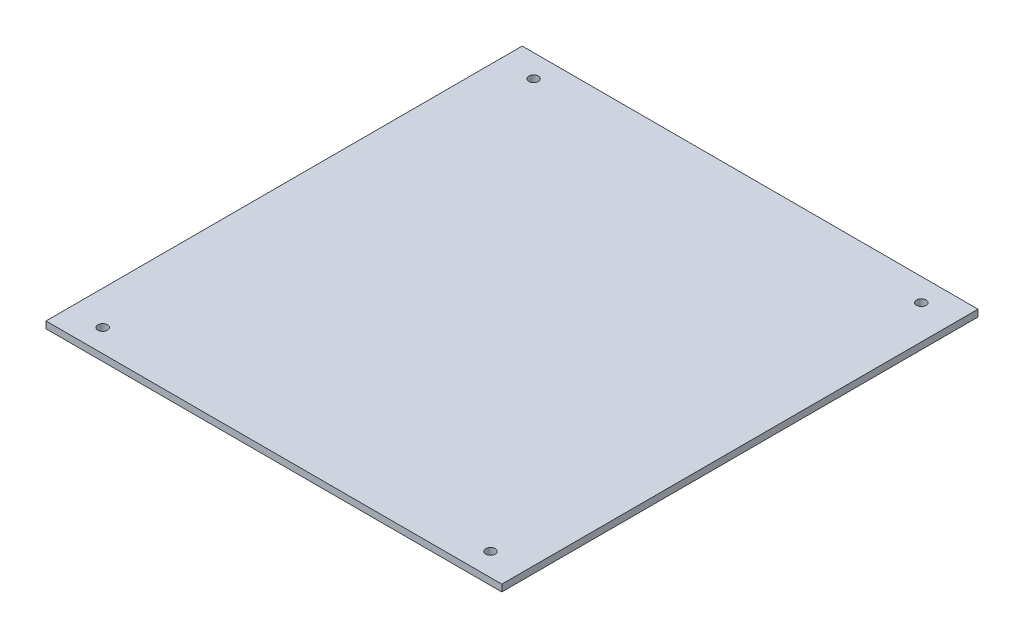
ISO-10303-21;
HEADER;
FILE_DESCRIPTION(('STEP AP214'),'2;1');
FILE_NAME('part.step','',(''),(''),'','','');
FILE_SCHEMA(('AUTOMOTIVE_DESIGN { 1 0 10303 214 1 1 1 1 }'));
ENDSEC;
DATA;
#1=APPLICATION_CONTEXT('core data for automotive mechanical design processes');
#2=APPLICATION_PROTOCOL_DEFINITION('international standard','automotive_design',2000,#1);
#3=PRODUCT_CONTEXT('',#1,'mechanical');
#4=PRODUCT('Part','Part','',(#3));
#5=PRODUCT_RELATED_PRODUCT_CATEGORY('part','',(#4));
#6=PRODUCT_DEFINITION_FORMATION('','',#4);
#7=PRODUCT_DEFINITION_CONTEXT('part definition',#1,'design');
#8=PRODUCT_DEFINITION('design','',#6,#7);
#9=PRODUCT_DEFINITION_SHAPE('','',#8);
#10=(LENGTH_UNIT() NAMED_UNIT(*) SI_UNIT(.MILLI.,.METRE.));
#11=(NAMED_UNIT(*) PLANE_ANGLE_UNIT() SI_UNIT($,.RADIAN.));
#12=(NAMED_UNIT(*) SI_UNIT($,.STERADIAN.) SOLID_ANGLE_UNIT());
#13=UNCERTAINTY_MEASURE_WITH_UNIT(LENGTH_MEASURE(1.E-05),#10,'distance_accuracy_value','');
#14=(GEOMETRIC_REPRESENTATION_CONTEXT(3) GLOBAL_UNCERTAINTY_ASSIGNED_CONTEXT((#13)) GLOBAL_UNIT_ASSIGNED_CONTEXT((#10,
#11,#12)) REPRESENTATION_CONTEXT('',''));
#15=CARTESIAN_POINT('',(0.,0.,0.));
#16=DIRECTION('',(0.,0.,1.));
#17=DIRECTION('',(1.,0.,0.));
#18=AXIS2_PLACEMENT_3D('',#15,#16,#17);
#19=CARTESIAN_POINT('',(0.,3.,0.));
#20=DIRECTION('',(0.,1.,0.));
#21=DIRECTION('',(0.,0.,1.));
#22=AXIS2_PLACEMENT_3D('',#19,#20,#21);
#23=PLANE('',#22);
#24=CARTESIAN_POINT('',(85.5,3.,95.));
#25=DIRECTION('',(0.,1.,0.));
#26=DIRECTION('',(0.,0.,1.));
#27=AXIS2_PLACEMENT_3D('',#24,#25,#26);
#28=CIRCLE('',#27,2.1);
#29=CARTESIAN_POINT('',(85.5,3.,97.1));
#30=VERTEX_POINT('',#29);
#31=EDGE_CURVE('E121',#30,#30,#28,.T.);
#32=ORIENTED_EDGE('',*,*,#31,.F.);
#33=EDGE_LOOP('',(#32));
#34=FACE_BOUND('',#33,.T.);
#35=CARTESIAN_POINT('',(-85.5000000000001,3.,-95.));
#36=DIRECTION('',(0.,1.,0.));
#37=DIRECTION('',(0.,0.,1.));
#38=AXIS2_PLACEMENT_3D('',#35,#36,#37);
#39=CIRCLE('',#38,2.1);
#40=CARTESIAN_POINT('',(-85.5000000000001,3.,-92.9));
#41=VERTEX_POINT('',#40);
#42=EDGE_CURVE('E100',#41,#41,#39,.T.);
#43=ORIENTED_EDGE('',*,*,#42,.F.);
#44=EDGE_LOOP('',(#43));
#45=FACE_BOUND('',#44,.T.);
#46=DIRECTION('',(0.,0.,-1.));
#47=VECTOR('',#46,1.);
#48=CARTESIAN_POINT('',(100.5,3.,-105.));
#49=LINE('',#48,#47);
#50=CARTESIAN_POINT('',(100.5,3.,105.));
#51=VERTEX_POINT('',#50);
#52=CARTESIAN_POINT('',(100.5,3.,-105.));
#53=VERTEX_POINT('',#52);
#54=EDGE_CURVE('E85',#51,#53,#49,.T.);
#55=ORIENTED_EDGE('',*,*,#54,.T.);
#56=DIRECTION('',(-1.,0.,0.));
#57=VECTOR('',#56,1.);
#58=CARTESIAN_POINT('',(-100.5,3.,-105.));
#59=LINE('',#58,#57);
#60=CARTESIAN_POINT('',(-100.5,3.,-105.));
#61=VERTEX_POINT('',#60);
#62=EDGE_CURVE('E80',#53,#61,#59,.T.);
#63=ORIENTED_EDGE('',*,*,#62,.T.);
#64=DIRECTION('',(0.,0.,1.));
#65=VECTOR('',#64,1.);
#66=CARTESIAN_POINT('',(-100.5,3.,-105.));
#67=LINE('',#66,#65);
#68=CARTESIAN_POINT('',(-100.5,3.,105.));
#69=VERTEX_POINT('',#68);
#70=EDGE_CURVE('E83',#61,#69,#67,.T.);
#71=ORIENTED_EDGE('',*,*,#70,.T.);
#72=DIRECTION('',(1.,0.,0.));
#73=VECTOR('',#72,1.);
#74=CARTESIAN_POINT('',(-100.5,3.,105.));
#75=LINE('',#74,#73);
#76=EDGE_CURVE('E50',#69,#51,#75,.T.);
#77=ORIENTED_EDGE('',*,*,#76,.T.);
#78=EDGE_LOOP('',(#55,#63,#71,#77));
#79=FACE_BOUND('',#78,.T.);
#80=CARTESIAN_POINT('',(85.5,3.,-95.));
#81=DIRECTION('',(0.,1.,0.));
#82=DIRECTION('',(0.,0.,1.));
#83=AXIS2_PLACEMENT_3D('',#80,#81,#82);
#84=CIRCLE('',#83,2.1);
#85=CARTESIAN_POINT('',(85.5,3.,-92.9));
#86=VERTEX_POINT('',#85);
#87=EDGE_CURVE('E115',#86,#86,#84,.T.);
#88=ORIENTED_EDGE('',*,*,#87,.F.);
#89=EDGE_LOOP('',(#88));
#90=FACE_BOUND('',#89,.T.);
#91=CARTESIAN_POINT('',(-85.5,3.,95.));
#92=DIRECTION('',(0.,1.,0.));
#93=DIRECTION('',(0.,0.,1.));
#94=AXIS2_PLACEMENT_3D('',#91,#92,#93);
#95=CIRCLE('',#94,2.1);
#96=CARTESIAN_POINT('',(-85.5,3.,97.1));
#97=VERTEX_POINT('',#96);
#98=EDGE_CURVE('E127',#97,#97,#95,.T.);
#99=ORIENTED_EDGE('',*,*,#98,.F.);
#100=EDGE_LOOP('',(#99));
#101=FACE_BOUND('',#100,.T.);
#102=ADVANCED_FACE('F33',(#34,#45,#79,#90,#101),#23,.T.);
#103=CARTESIAN_POINT('',(0.,0.,0.));
#104=DIRECTION('',(0.,1.,0.));
#105=DIRECTION('',(0.,0.,1.));
#106=AXIS2_PLACEMENT_3D('',#103,#104,#105);
#107=PLANE('',#106);
#108=DIRECTION('',(0.,0.,-1.));
#109=VECTOR('',#108,1.);
#110=CARTESIAN_POINT('',(100.5,0.,-105.));
#111=LINE('',#110,#109);
#112=CARTESIAN_POINT('',(100.5,0.,105.));
#113=VERTEX_POINT('',#112);
#114=CARTESIAN_POINT('',(100.5,0.,-105.));
#115=VERTEX_POINT('',#114);
#116=EDGE_CURVE('E97',#113,#115,#111,.T.);
#117=ORIENTED_EDGE('',*,*,#116,.F.);
#118=DIRECTION('',(1.,0.,0.));
#119=VECTOR('',#118,1.);
#120=CARTESIAN_POINT('',(-100.5,0.,105.));
#121=LINE('',#120,#119);
#122=CARTESIAN_POINT('',(-100.5,0.,105.));
#123=VERTEX_POINT('',#122);
#124=EDGE_CURVE('E73',#123,#113,#121,.T.);
#125=ORIENTED_EDGE('',*,*,#124,.F.);
#126=DIRECTION('',(0.,0.,1.));
#127=VECTOR('',#126,1.);
#128=CARTESIAN_POINT('',(-100.5,0.,-105.));
#129=LINE('',#128,#127);
#130=CARTESIAN_POINT('',(-100.5,0.,-105.));
#131=VERTEX_POINT('',#130);
#132=EDGE_CURVE('E67',#131,#123,#129,.T.);
#133=ORIENTED_EDGE('',*,*,#132,.F.);
#134=DIRECTION('',(-1.,0.,0.));
#135=VECTOR('',#134,1.);
#136=CARTESIAN_POINT('',(-100.5,0.,-105.));
#137=LINE('',#136,#135);
#138=EDGE_CURVE('E89',#115,#131,#137,.T.);
#139=ORIENTED_EDGE('',*,*,#138,.F.);
#140=EDGE_LOOP('',(#117,#125,#133,#139));
#141=FACE_BOUND('',#140,.T.);
#142=CARTESIAN_POINT('',(-85.5000000000001,0.,-95.));
#143=DIRECTION('',(0.,1.,0.));
#144=DIRECTION('',(0.,0.,1.));
#145=AXIS2_PLACEMENT_3D('',#142,#143,#144);
#146=CIRCLE('',#145,2.1);
#147=CARTESIAN_POINT('',(-85.5000000000001,0.,-92.9));
#148=VERTEX_POINT('',#147);
#149=EDGE_CURVE('E112',#148,#148,#146,.T.);
#150=ORIENTED_EDGE('',*,*,#149,.T.);
#151=EDGE_LOOP('',(#150));
#152=FACE_BOUND('',#151,.T.);
#153=CARTESIAN_POINT('',(85.5,0.,-95.));
#154=DIRECTION('',(0.,1.,0.));
#155=DIRECTION('',(0.,0.,1.));
#156=AXIS2_PLACEMENT_3D('',#153,#154,#155);
#157=CIRCLE('',#156,2.1);
#158=CARTESIAN_POINT('',(85.5,0.,-92.9));
#159=VERTEX_POINT('',#158);
#160=EDGE_CURVE('E118',#159,#159,#157,.T.);
#161=ORIENTED_EDGE('',*,*,#160,.T.);
#162=EDGE_LOOP('',(#161));
#163=FACE_BOUND('',#162,.T.);
#164=CARTESIAN_POINT('',(85.5,0.,95.));
#165=DIRECTION('',(0.,1.,0.));
#166=DIRECTION('',(0.,0.,1.));
#167=AXIS2_PLACEMENT_3D('',#164,#165,#166);
#168=CIRCLE('',#167,2.1);
#169=CARTESIAN_POINT('',(85.5,0.,97.1));
#170=VERTEX_POINT('',#169);
#171=EDGE_CURVE('E124',#170,#170,#168,.T.);
#172=ORIENTED_EDGE('',*,*,#171,.T.);
#173=EDGE_LOOP('',(#172));
#174=FACE_BOUND('',#173,.T.);
#175=CARTESIAN_POINT('',(-85.5,0.,95.));
#176=DIRECTION('',(0.,1.,0.));
#177=DIRECTION('',(0.,0.,1.));
#178=AXIS2_PLACEMENT_3D('',#175,#176,#177);
#179=CIRCLE('',#178,2.1);
#180=CARTESIAN_POINT('',(-85.5,0.,97.1));
#181=VERTEX_POINT('',#180);
#182=EDGE_CURVE('E130',#181,#181,#179,.T.);
#183=ORIENTED_EDGE('',*,*,#182,.T.);
#184=EDGE_LOOP('',(#183));
#185=FACE_BOUND('',#184,.T.);
#186=ADVANCED_FACE('F108',(#141,#152,#163,#174,#185),#107,.F.);
#187=CARTESIAN_POINT('',(100.5,3.,-105.));
#188=DIRECTION('',(-1.,0.,0.));
#189=DIRECTION('',(0.,0.,1.));
#190=AXIS2_PLACEMENT_3D('',#187,#188,#189);
#191=PLANE('',#190);
#192=ORIENTED_EDGE('',*,*,#116,.T.);
#193=DIRECTION('',(0.,-1.,0.));
#194=VECTOR('',#193,1.);
#195=CARTESIAN_POINT('',(100.5,3.,-105.));
#196=LINE('',#195,#194);
#197=EDGE_CURVE('E11',#53,#115,#196,.T.);
#198=ORIENTED_EDGE('',*,*,#197,.F.);
#199=ORIENTED_EDGE('',*,*,#54,.F.);
#200=DIRECTION('',(0.,-1.,0.));
#201=VECTOR('',#200,1.);
#202=CARTESIAN_POINT('',(100.5,3.,105.));
#203=LINE('',#202,#201);
#204=EDGE_CURVE('E93',#51,#113,#203,.T.);
#205=ORIENTED_EDGE('',*,*,#204,.T.);
#206=EDGE_LOOP('',(#192,#198,#199,#205));
#207=FACE_BOUND('',#206,.T.);
#208=ADVANCED_FACE('F35',(#207),#191,.F.);
#209=CARTESIAN_POINT('',(-100.5,3.,-105.));
#210=DIRECTION('',(0.,0.,1.));
#211=DIRECTION('',(1.,0.,0.));
#212=AXIS2_PLACEMENT_3D('',#209,#210,#211);
#213=PLANE('',#212);
#214=ORIENTED_EDGE('',*,*,#138,.T.);
#215=DIRECTION('',(0.,-1.,0.));
#216=VECTOR('',#215,1.);
#217=CARTESIAN_POINT('',(-100.5,3.,-105.));
#218=LINE('',#217,#216);
#219=EDGE_CURVE('E42',#61,#131,#218,.T.);
#220=ORIENTED_EDGE('',*,*,#219,.F.);
#221=ORIENTED_EDGE('',*,*,#62,.F.);
#222=ORIENTED_EDGE('',*,*,#197,.T.);
#223=EDGE_LOOP('',(#214,#220,#221,#222));
#224=FACE_BOUND('',#223,.T.);
#225=ADVANCED_FACE('F88',(#224),#213,.F.);
#226=CARTESIAN_POINT('',(-100.5,3.,-105.));
#227=DIRECTION('',(1.,0.,0.));
#228=DIRECTION('',(0.,0.,-1.));
#229=AXIS2_PLACEMENT_3D('',#226,#227,#228);
#230=PLANE('',#229);
#231=ORIENTED_EDGE('',*,*,#132,.T.);
#232=DIRECTION('',(0.,-1.,0.));
#233=VECTOR('',#232,1.);
#234=CARTESIAN_POINT('',(-100.5,3.,105.));
#235=LINE('',#234,#233);
#236=EDGE_CURVE('E90',#69,#123,#235,.T.);
#237=ORIENTED_EDGE('',*,*,#236,.F.);
#238=ORIENTED_EDGE('',*,*,#70,.F.);
#239=ORIENTED_EDGE('',*,*,#219,.T.);
#240=EDGE_LOOP('',(#231,#237,#238,#239));
#241=FACE_BOUND('',#240,.T.);
#242=ADVANCED_FACE('F91',(#241),#230,.F.);
#243=CARTESIAN_POINT('',(-100.5,3.,105.));
#244=DIRECTION('',(0.,0.,-1.));
#245=DIRECTION('',(-1.,0.,0.));
#246=AXIS2_PLACEMENT_3D('',#243,#244,#245);
#247=PLANE('',#246);
#248=ORIENTED_EDGE('',*,*,#124,.T.);
#249=ORIENTED_EDGE('',*,*,#204,.F.);
#250=ORIENTED_EDGE('',*,*,#76,.F.);
#251=ORIENTED_EDGE('',*,*,#236,.T.);
#252=EDGE_LOOP('',(#248,#249,#250,#251));
#253=FACE_BOUND('',#252,.T.);
#254=ADVANCED_FACE('F105',(#253),#247,.F.);
#255=CARTESIAN_POINT('',(-85.5000000000001,3.,-95.));
#256=DIRECTION('',(0.,-1.,0.));
#257=DIRECTION('',(0.,0.,-1.));
#258=AXIS2_PLACEMENT_3D('',#255,#256,#257);
#259=CYLINDRICAL_SURFACE('',#258,2.1);
#260=ORIENTED_EDGE('',*,*,#42,.T.);
#261=EDGE_LOOP('',(#260));
#262=FACE_BOUND('',#261,.T.);
#263=ORIENTED_EDGE('',*,*,#149,.F.);
#264=EDGE_LOOP('',(#263));
#265=FACE_BOUND('',#264,.T.);
#266=ADVANCED_FACE('F149',(#262,#265),#259,.F.);
#267=CARTESIAN_POINT('',(85.5,3.,-95.));
#268=DIRECTION('',(0.,-1.,0.));
#269=DIRECTION('',(0.,0.,-1.));
#270=AXIS2_PLACEMENT_3D('',#267,#268,#269);
#271=CYLINDRICAL_SURFACE('',#270,2.1);
#272=ORIENTED_EDGE('',*,*,#87,.T.);
#273=EDGE_LOOP('',(#272));
#274=FACE_BOUND('',#273,.T.);
#275=ORIENTED_EDGE('',*,*,#160,.F.);
#276=EDGE_LOOP('',(#275));
#277=FACE_BOUND('',#276,.T.);
#278=ADVANCED_FACE('F195',(#274,#277),#271,.F.);
#279=CARTESIAN_POINT('',(85.5,3.,95.));
#280=DIRECTION('',(0.,-1.,0.));
#281=DIRECTION('',(0.,0.,-1.));
#282=AXIS2_PLACEMENT_3D('',#279,#280,#281);
#283=CYLINDRICAL_SURFACE('',#282,2.1);
#284=ORIENTED_EDGE('',*,*,#31,.T.);
#285=EDGE_LOOP('',(#284));
#286=FACE_BOUND('',#285,.T.);
#287=ORIENTED_EDGE('',*,*,#171,.F.);
#288=EDGE_LOOP('',(#287));
#289=FACE_BOUND('',#288,.T.);
#290=ADVANCED_FACE('F203',(#286,#289),#283,.F.);
#291=CARTESIAN_POINT('',(-85.5,3.,95.));
#292=DIRECTION('',(0.,-1.,0.));
#293=DIRECTION('',(0.,0.,-1.));
#294=AXIS2_PLACEMENT_3D('',#291,#292,#293);
#295=CYLINDRICAL_SURFACE('',#294,2.1);
#296=ORIENTED_EDGE('',*,*,#98,.T.);
#297=EDGE_LOOP('',(#296));
#298=FACE_BOUND('',#297,.T.);
#299=ORIENTED_EDGE('',*,*,#182,.F.);
#300=EDGE_LOOP('',(#299));
#301=FACE_BOUND('',#300,.T.);
#302=ADVANCED_FACE('F136',(#298,#301),#295,.F.);
#303=CLOSED_SHELL('',(#102,#186,#208,#225,#242,#254,#266,#278,#290,#302));
#304=MANIFOLD_SOLID_BREP('B2',#303);
#305=ADVANCED_BREP_SHAPE_REPRESENTATION('',(#18,#304),#14);
#306=SHAPE_DEFINITION_REPRESENTATION(#9,#305);
ENDSEC;
END-ISO-10303-21;
